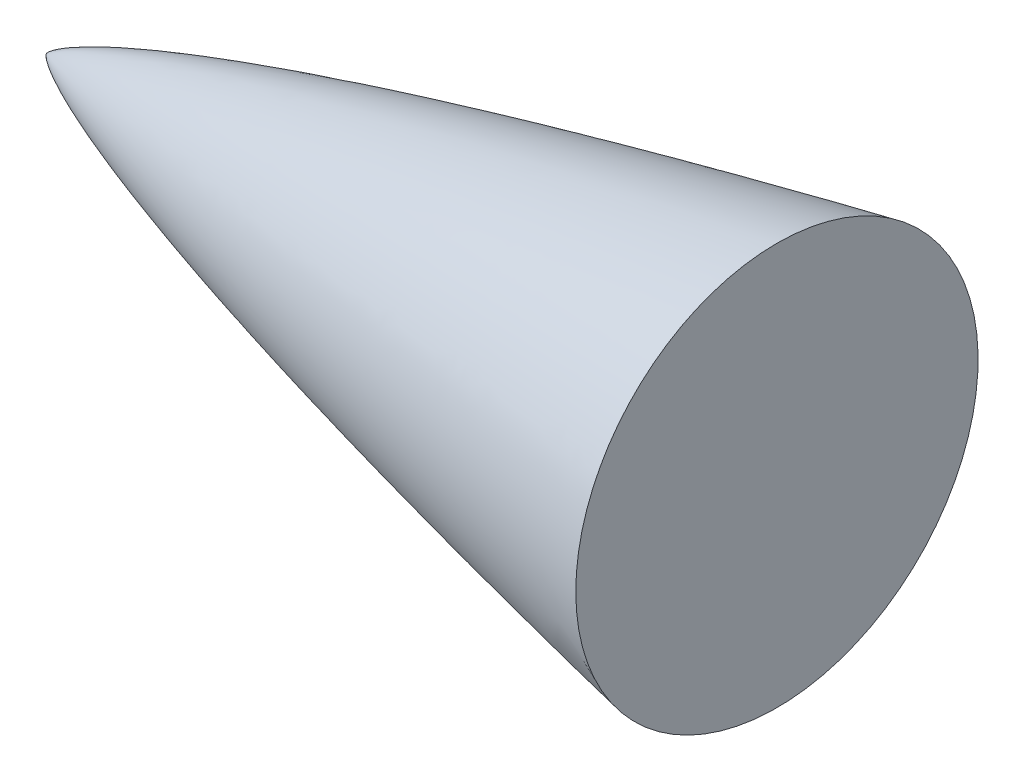
ISO-10303-21;
HEADER;
FILE_DESCRIPTION(('STEP AP214'),'2;1');
FILE_NAME('part.step','',(''),(''),'','','');
FILE_SCHEMA(('AUTOMOTIVE_DESIGN { 1 0 10303 214 1 1 1 1 }'));
ENDSEC;
DATA;
#1=APPLICATION_CONTEXT('core data for automotive mechanical design processes');
#2=APPLICATION_PROTOCOL_DEFINITION('international standard','automotive_design',2000,#1);
#3=PRODUCT_CONTEXT('',#1,'mechanical');
#4=PRODUCT('Part','Part','',(#3));
#5=PRODUCT_RELATED_PRODUCT_CATEGORY('part','',(#4));
#6=PRODUCT_DEFINITION_FORMATION('','',#4);
#7=PRODUCT_DEFINITION_CONTEXT('part definition',#1,'design');
#8=PRODUCT_DEFINITION('design','',#6,#7);
#9=PRODUCT_DEFINITION_SHAPE('','',#8);
#10=(LENGTH_UNIT() NAMED_UNIT(*) SI_UNIT(.MILLI.,.METRE.));
#11=(NAMED_UNIT(*) PLANE_ANGLE_UNIT() SI_UNIT($,.RADIAN.));
#12=(NAMED_UNIT(*) SI_UNIT($,.STERADIAN.) SOLID_ANGLE_UNIT());
#13=UNCERTAINTY_MEASURE_WITH_UNIT(LENGTH_MEASURE(1.E-05),#10,'distance_accuracy_value','');
#14=(GEOMETRIC_REPRESENTATION_CONTEXT(3) GLOBAL_UNCERTAINTY_ASSIGNED_CONTEXT((#13)) GLOBAL_UNIT_ASSIGNED_CONTEXT((#10,
#11,#12)) REPRESENTATION_CONTEXT('',''));
#15=CARTESIAN_POINT('',(0.,0.,0.));
#16=DIRECTION('',(0.,0.,1.));
#17=DIRECTION('',(1.,0.,0.));
#18=AXIS2_PLACEMENT_3D('',#15,#16,#17);
#19=CARTESIAN_POINT('',(44.4499999998539,12.2403780411051,0.));
#20=CARTESIAN_POINT('',(43.678800663067,12.0864445536475,0.));
#21=CARTESIAN_POINT('',(42.1417060281599,11.7769431059502,0.));
#22=CARTESIAN_POINT('',(39.1374851971581,11.1648544233929,0.));
#23=CARTESIAN_POINT('',(36.1346382601022,10.5305957320397,0.));
#24=CARTESIAN_POINT('',(32.5312271923117,9.7563342738732,0.));
#25=CARTESIAN_POINT('',(29.2981497279027,9.03364845778289,0.));
#26=CARTESIAN_POINT('',(25.8485751509983,8.24258304263651,0.));
#27=CARTESIAN_POINT('',(22.5404308490302,7.45104445623699,0.));
#28=CARTESIAN_POINT('',(19.1577013595069,6.61110028464296,0.));
#29=CARTESIAN_POINT('',(15.8351683774207,5.74326247049423,0.));
#30=CARTESIAN_POINT('',(12.4936826338801,4.82207604138032,0.));
#31=CARTESIAN_POINT('',(9.22641349996277,3.85530066756245,0.));
#32=CARTESIAN_POINT('',(6.38160109753413,2.93589634247626,0.));
#33=CARTESIAN_POINT('',(4.09295059045692,2.11124740726071,0.));
#34=CARTESIAN_POINT('',(2.46279613712391,1.44279331280536,0.));
#35=CARTESIAN_POINT('',(1.51138898745675,1.00171877352113,0.));
#36=CARTESIAN_POINT('',(0.901635525847715,0.680174208202772,0.));
#37=CARTESIAN_POINT('',(0.544576148646195,0.465759826182617,0.));
#38=CARTESIAN_POINT('',(0.332159509315923,0.321448771594143,0.));
#39=CARTESIAN_POINT('',(0.205163795355127,0.22377355956992,0.));
#40=CARTESIAN_POINT('',(0.128401711956293,0.157512982084969,0.));
#41=CARTESIAN_POINT('',(0.0811094624148025,0.111493123977724,0.));
#42=CARTESIAN_POINT('',(0.0495842936068167,0.0773382435936719,0.));
#43=CARTESIAN_POINT('',(0.0258665297584175,0.0476780016362933,0.));
#44=CARTESIAN_POINT('',(0.0105511334225754,0.0262748295683443,0.));
#45=CARTESIAN_POINT('',(0.00301199312585559,0.0097629050683679,0.));
#46=CARTESIAN_POINT('',(0.,0.,0.));
#47=B_SPLINE_CURVE_WITH_KNOTS('',4,(#19,#20,#21,#22,#23,#24,#25,#26,#27,#28,#29,#30,#31,#32,#33,
#34,#35,#36,#37,#38,#39,#40,#41,#42,#43,#44,#45,#46),.UNSPECIFIED.,.F.,.F.,(5,1,1,1,1,1,1,1,1,1,
1,1,1,1,1,1,1,1,1,1,1,1,1,1,5),(0.,0.0679699247571307,0.135939850099123,0.203909775678574,
0.271879701238029,0.339849626927576,0.407819554174716,0.475789477512958,0.543759405723729,
0.611729329084798,0.679699256257167,0.747669172248057,0.812633032457565,0.846617954452944,
0.871417624482987,0.886197237326969,0.8952316854441,0.900819023365049,0.904212610405943,
0.906389882935161,0.907845489034672,0.908792492345662,0.909409182631141,0.910041707231012,
0.910842976088599),.UNSPECIFIED.);
#48=CARTESIAN_POINT('',(0.,0.,0.));
#49=DIRECTION('',(-1.,0.,0.));
#50=AXIS1_PLACEMENT('',#48,#49);
#51=SURFACE_OF_REVOLUTION('',#47,#50);
#52=CARTESIAN_POINT('',(0.,0.,0.));
#53=VERTEX_POINT('',#52);
#54=VERTEX_LOOP('',#53);
#55=FACE_BOUND('',#54,.T.);
#56=CARTESIAN_POINT('',(44.45,0.,0.));
#57=DIRECTION('',(-1.,0.,0.));
#58=DIRECTION('',(0.,0.,1.));
#59=AXIS2_PLACEMENT_3D('',#56,#57,#58);
#60=CIRCLE('',#59,12.2403780411132);
#61=CARTESIAN_POINT('',(44.45,0.,12.2403780411132));
#62=VERTEX_POINT('',#61);
#63=EDGE_CURVE('E11',#62,#62,#60,.T.);
#64=ORIENTED_EDGE('',*,*,#63,.T.);
#65=EDGE_LOOP('',(#64));
#66=FACE_BOUND('',#65,.T.);
#67=ADVANCED_FACE('F36',(#55,#66),#51,.T.);
#68=CARTESIAN_POINT('',(44.45,0.,0.));
#69=DIRECTION('',(-1.,0.,0.));
#70=DIRECTION('',(0.,0.,1.));
#71=AXIS2_PLACEMENT_3D('',#68,#69,#70);
#72=PLANE('',#71);
#73=ORIENTED_EDGE('',*,*,#63,.F.);
#74=EDGE_LOOP('',(#73));
#75=FACE_BOUND('',#74,.T.);
#76=ADVANCED_FACE('F46',(#75),#72,.F.);
#77=CLOSED_SHELL('',(#67,#76));
#78=MANIFOLD_SOLID_BREP('B2',#77);
#79=ADVANCED_BREP_SHAPE_REPRESENTATION('',(#18,#78),#14);
#80=SHAPE_DEFINITION_REPRESENTATION(#9,#79);
ENDSEC;
END-ISO-10303-21;
